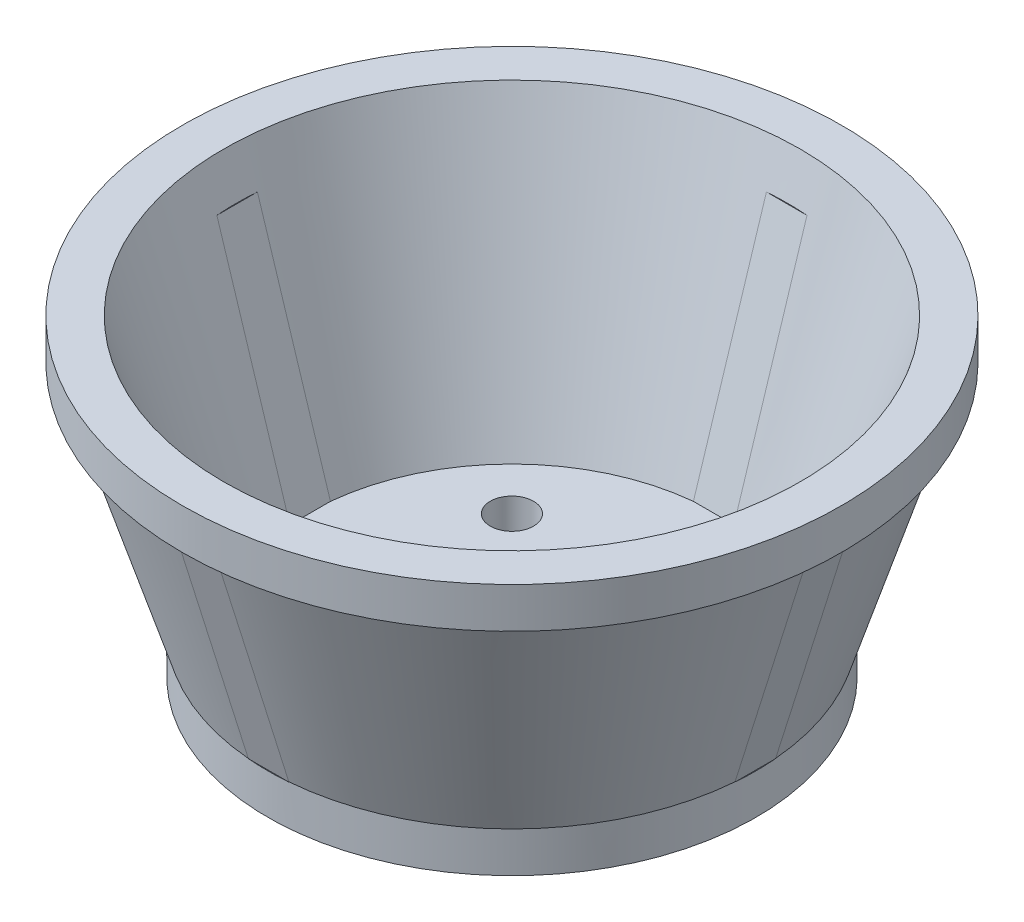
ISO-10303-21;
HEADER;
FILE_DESCRIPTION(('STEP AP214'),'2;1');
FILE_NAME('part.step','',(''),(''),'','','');
FILE_SCHEMA(('AUTOMOTIVE_DESIGN { 1 0 10303 214 1 1 1 1 }'));
ENDSEC;
DATA;
#1=APPLICATION_CONTEXT('core data for automotive mechanical design processes');
#2=APPLICATION_PROTOCOL_DEFINITION('international standard','automotive_design',2000,#1);
#3=PRODUCT_CONTEXT('',#1,'mechanical');
#4=PRODUCT('Part','Part','',(#3));
#5=PRODUCT_RELATED_PRODUCT_CATEGORY('part','',(#4));
#6=PRODUCT_DEFINITION_FORMATION('','',#4);
#7=PRODUCT_DEFINITION_CONTEXT('part definition',#1,'design');
#8=PRODUCT_DEFINITION('design','',#6,#7);
#9=PRODUCT_DEFINITION_SHAPE('','',#8);
#10=(LENGTH_UNIT() NAMED_UNIT(*) SI_UNIT(.MILLI.,.METRE.));
#11=(NAMED_UNIT(*) PLANE_ANGLE_UNIT() SI_UNIT($,.RADIAN.));
#12=(NAMED_UNIT(*) SI_UNIT($,.STERADIAN.) SOLID_ANGLE_UNIT());
#13=UNCERTAINTY_MEASURE_WITH_UNIT(LENGTH_MEASURE(1.E-05),#10,'distance_accuracy_value','');
#14=(GEOMETRIC_REPRESENTATION_CONTEXT(3) GLOBAL_UNCERTAINTY_ASSIGNED_CONTEXT((#13)) GLOBAL_UNIT_ASSIGNED_CONTEXT((#10,
#11,#12)) REPRESENTATION_CONTEXT('',''));
#15=CARTESIAN_POINT('',(0.,0.,0.));
#16=DIRECTION('',(0.,0.,1.));
#17=DIRECTION('',(1.,0.,0.));
#18=AXIS2_PLACEMENT_3D('',#15,#16,#17);
#19=CARTESIAN_POINT('',(55.5,-46.25,0.));
#20=DIRECTION('',(0.,1.,0.));
#21=DIRECTION('',(0.,0.,1.));
#22=AXIS2_PLACEMENT_3D('',#19,#20,#21);
#23=PLANE('',#22);
#24=CARTESIAN_POINT('',(-14.8492424049174,-46.25,14.8492424049175));
#25=DIRECTION('',(0.,-1.,0.));
#26=DIRECTION('',(-1.,0.,0.));
#27=AXIS2_PLACEMENT_3D('',#24,#25,#26);
#28=CIRCLE('',#27,3.2);
#29=CARTESIAN_POINT('',(-18.0492424049174,-46.25,14.8492424049175));
#30=VERTEX_POINT('',#29);
#31=EDGE_CURVE('E655',#30,#30,#28,.T.);
#32=ORIENTED_EDGE('',*,*,#31,.F.);
#33=EDGE_LOOP('',(#32));
#34=FACE_BOUND('',#33,.T.);
#35=CARTESIAN_POINT('',(-14.8492424049173,-46.25,-14.8492424049176));
#36=DIRECTION('',(0.,-1.,0.));
#37=DIRECTION('',(0.,0.,-1.));
#38=AXIS2_PLACEMENT_3D('',#35,#36,#37);
#39=CIRCLE('',#38,3.2);
#40=CARTESIAN_POINT('',(-14.8492424049173,-46.25,-18.0492424049176));
#41=VERTEX_POINT('',#40);
#42=EDGE_CURVE('E654',#41,#41,#39,.T.);
#43=ORIENTED_EDGE('',*,*,#42,.F.);
#44=EDGE_LOOP('',(#43));
#45=FACE_BOUND('',#44,.T.);
#46=CARTESIAN_POINT('',(14.8492424049175,-46.25,14.8492424049175));
#47=DIRECTION('',(0.,-1.,0.));
#48=DIRECTION('',(0.,0.,1.));
#49=AXIS2_PLACEMENT_3D('',#46,#47,#48);
#50=CIRCLE('',#49,3.2);
#51=CARTESIAN_POINT('',(14.8492424049175,-46.25,18.0492424049175));
#52=VERTEX_POINT('',#51);
#53=EDGE_CURVE('E647',#52,#52,#50,.T.);
#54=ORIENTED_EDGE('',*,*,#53,.F.);
#55=EDGE_LOOP('',(#54));
#56=FACE_BOUND('',#55,.T.);
#57=CARTESIAN_POINT('',(14.8492424049175,-46.25,-14.8492424049175));
#58=DIRECTION('',(0.,-1.,0.));
#59=DIRECTION('',(1.,0.,0.));
#60=AXIS2_PLACEMENT_3D('',#57,#58,#59);
#61=CIRCLE('',#60,3.2);
#62=CARTESIAN_POINT('',(18.0492424049175,-46.25,-14.8492424049175));
#63=VERTEX_POINT('',#62);
#64=EDGE_CURVE('E641',#63,#63,#61,.T.);
#65=ORIENTED_EDGE('',*,*,#64,.F.);
#66=EDGE_LOOP('',(#65));
#67=FACE_BOUND('',#66,.T.);
#68=CARTESIAN_POINT('',(0.,-46.2500000000001,0.));
#69=DIRECTION('',(0.,1.,0.));
#70=DIRECTION('',(-1.,0.,0.));
#71=AXIS2_PLACEMENT_3D('',#68,#69,#70);
#72=CIRCLE('',#71,3.175);
#73=CARTESIAN_POINT('',(-3.175,-46.2500000000001,0.));
#74=VERTEX_POINT('',#73);
#75=EDGE_CURVE('E636',#74,#74,#72,.T.);
#76=ORIENTED_EDGE('',*,*,#75,.T.);
#77=EDGE_LOOP('',(#76));
#78=FACE_BOUND('',#77,.T.);
#79=CARTESIAN_POINT('',(0.,-46.25,0.));
#80=DIRECTION('',(0.,-1.,0.));
#81=DIRECTION('',(0.,0.,-1.));
#82=AXIS2_PLACEMENT_3D('',#79,#80,#81);
#83=CIRCLE('',#82,36.1179115486692);
#84=CARTESIAN_POINT('',(0.,-46.25,-36.1179115486692));
#85=VERTEX_POINT('',#84);
#86=EDGE_CURVE('E728',#85,#85,#83,.T.);
#87=ORIENTED_EDGE('',*,*,#86,.T.);
#88=EDGE_LOOP('',(#87));
#89=FACE_BOUND('',#88,.T.);
#90=ADVANCED_FACE('F56',(#34,#45,#56,#67,#78,#89),#23,.F.);
#91=CARTESIAN_POINT('',(36.1179115486692,-40.29713119,0.));
#92=DIRECTION('',(0.,-1.,0.));
#93=DIRECTION('',(0.,0.,-1.));
#94=AXIS2_PLACEMENT_3D('',#91,#92,#93);
#95=PLANE('',#94);
#96=CARTESIAN_POINT('',(0.,-40.29713119,0.));
#97=DIRECTION('',(0.,-1.,0.));
#98=DIRECTION('',(0.,0.,-1.));
#99=AXIS2_PLACEMENT_3D('',#96,#97,#98);
#100=CIRCLE('',#99,36.1179115486692);
#101=CARTESIAN_POINT('',(35.9931039872569,-40.29713119,-3.00000000000002));
#102=VERTEX_POINT('',#101);
#103=CARTESIAN_POINT('',(35.9931039872569,-40.29713119,3.00000000000002));
#104=VERTEX_POINT('',#103);
#105=EDGE_CURVE('E257',#102,#104,#100,.T.);
#106=ORIENTED_EDGE('',*,*,#105,.F.);
#107=DIRECTION('',(0.,0.,1.));
#108=VECTOR('',#107,1.);
#109=CARTESIAN_POINT('',(35.9931039872569,-40.2971311900001,-48.7589667799538));
#110=LINE('',#109,#108);
#111=EDGE_CURVE('E392',#102,#104,#110,.T.);
#112=ORIENTED_EDGE('',*,*,#111,.T.);
#113=EDGE_LOOP('',(#106,#112));
#114=FACE_BOUND('',#113,.T.);
#115=ADVANCED_FACE('F753',(#114),#95,.F.);
#116=CARTESIAN_POINT('',(2.99999999999994,-40.2971311900001,35.993103987257));
#117=VERTEX_POINT('',#116);
#118=CARTESIAN_POINT('',(-3.00000000000014,-40.2971311900001,35.9931039872569));
#119=VERTEX_POINT('',#118);
#120=EDGE_CURVE('E803',#117,#119,#100,.T.);
#121=ORIENTED_EDGE('',*,*,#120,.F.);
#122=DIRECTION('',(-1.,0.,0.));
#123=VECTOR('',#122,1.);
#124=CARTESIAN_POINT('',(48.7589667799538,-40.2971311900001,35.9931039872571));
#125=LINE('',#124,#123);
#126=EDGE_CURVE('E370',#117,#119,#125,.T.);
#127=ORIENTED_EDGE('',*,*,#126,.T.);
#128=EDGE_LOOP('',(#121,#127));
#129=FACE_BOUND('',#128,.T.);
#130=ADVANCED_FACE('F759',(#129),#95,.F.);
#131=CARTESIAN_POINT('',(-35.9931039872569,-40.2971311900001,3.00000000000007));
#132=VERTEX_POINT('',#131);
#133=CARTESIAN_POINT('',(-35.9931039872569,-40.29713119,-3.00000000000002));
#134=VERTEX_POINT('',#133);
#135=EDGE_CURVE('E266',#132,#134,#100,.T.);
#136=ORIENTED_EDGE('',*,*,#135,.F.);
#137=DIRECTION('',(0.,0.,-1.));
#138=VECTOR('',#137,1.);
#139=CARTESIAN_POINT('',(-35.9931039872569,-40.2971311900001,48.7589667799538));
#140=LINE('',#139,#138);
#141=EDGE_CURVE('E314',#132,#134,#140,.T.);
#142=ORIENTED_EDGE('',*,*,#141,.T.);
#143=EDGE_LOOP('',(#136,#142));
#144=FACE_BOUND('',#143,.T.);
#145=ADVANCED_FACE('F719',(#144),#95,.F.);
#146=CARTESIAN_POINT('',(-2.99999999999969,-40.2971311900001,-35.993103987257));
#147=VERTEX_POINT('',#146);
#148=CARTESIAN_POINT('',(3.00000000000047,-40.29713119,-35.9931039872569));
#149=VERTEX_POINT('',#148);
#150=EDGE_CURVE('E252',#147,#149,#100,.T.);
#151=ORIENTED_EDGE('',*,*,#150,.F.);
#152=DIRECTION('',(1.,0.,0.));
#153=VECTOR('',#152,1.);
#154=CARTESIAN_POINT('',(-48.7589667799539,-40.2971311900001,-35.9931039872574));
#155=LINE('',#154,#153);
#156=EDGE_CURVE('E319',#147,#149,#155,.T.);
#157=ORIENTED_EDGE('',*,*,#156,.T.);
#158=EDGE_LOOP('',(#151,#157));
#159=FACE_BOUND('',#158,.T.);
#160=ADVANCED_FACE('F750',(#159),#95,.F.);
#161=CARTESIAN_POINT('',(0.,-40.2971311900001,0.));
#162=DIRECTION('',(0.,1.,0.));
#163=DIRECTION('',(0.,0.,1.));
#164=AXIS2_PLACEMENT_3D('',#161,#162,#163);
#165=CONICAL_SURFACE('',#164,36.1179115486692,0.304506404561857);
#166=CARTESIAN_POINT('',(0.,-40.25,0.));
#167=DIRECTION('',(0.,-1.,0.));
#168=DIRECTION('',(0.,0.,-1.));
#169=AXIS2_PLACEMENT_3D('',#166,#167,#168);
#170=CIRCLE('',#169,36.1327239764503);
#171=CARTESIAN_POINT('',(-3.00000000868257,-40.25,36.0079677558488));
#172=VERTEX_POINT('',#171);
#173=CARTESIAN_POINT('',(-36.0079559287124,-40.25,3.00014196235004));
#174=VERTEX_POINT('',#173);
#175=EDGE_CURVE('E277',#172,#174,#170,.T.);
#176=ORIENTED_EDGE('',*,*,#175,.F.);
#177=CARTESIAN_POINT('',(-3.00000000000018,-6.00000000000002,46.8007874877763));
#178=DIRECTION('',(0.,-0.953766069075102,-0.300549971686953));
#179=VECTOR('',#178,1.);
#180=LINE('',#177,#179);
#181=CARTESIAN_POINT('',(-3.00000000000016,-6.00000000000004,46.8007874877763));
#182=VERTEX_POINT('',#181);
#183=EDGE_CURVE('E382',#182,#172,#180,.T.);
#184=ORIENTED_EDGE('',*,*,#183,.F.);
#185=CARTESIAN_POINT('',(0.,-6.00000000000004,0.));
#186=DIRECTION('',(0.,1.,0.));
#187=DIRECTION('',(0.,0.,1.));
#188=AXIS2_PLACEMENT_3D('',#185,#186,#187);
#189=CIRCLE('',#188,46.8968411460303);
#190=CARTESIAN_POINT('',(-46.8007874877763,-6.00000000000004,3.00000000000013));
#191=VERTEX_POINT('',#190);
#192=EDGE_CURVE('E313',#191,#182,#189,.T.);
#193=ORIENTED_EDGE('',*,*,#192,.F.);
#194=CARTESIAN_POINT('',(-41.396945737515,-23.1485655950052,0.));
#195=DIRECTION('',(0.953766069075102,0.300549971686953,0.));
#196=DIRECTION('',(-0.300549971686953,0.953766069075102,0.));
#197=AXIS2_PLACEMENT_3D('',#194,#195,#196);
#198=ELLIPSE('',#197,138.104742164432,3.0257519471421);
#199=EDGE_CURVE('E306',#174,#191,#198,.F.);
#200=ORIENTED_EDGE('',*,*,#199,.F.);
#201=EDGE_LOOP('',(#176,#184,#193,#200));
#202=FACE_BOUND('',#201,.T.);
#203=ADVANCED_FACE('F311',(#202),#165,.T.);
#204=CARTESIAN_POINT('',(0.,-40.25,0.));
#205=DIRECTION('',(0.,-1.,0.));
#206=DIRECTION('',(0.,0.,-1.));
#207=AXIS2_PLACEMENT_3D('',#204,#205,#206);
#208=CIRCLE('',#207,36.1327239764503);
#209=CARTESIAN_POINT('',(36.0079677558489,-40.25,3.00000000868247));
#210=VERTEX_POINT('',#209);
#211=CARTESIAN_POINT('',(3.00014196235066,-40.25,36.0079559287124));
#212=VERTEX_POINT('',#211);
#213=EDGE_CURVE('E790',#210,#212,#208,.T.);
#214=ORIENTED_EDGE('',*,*,#213,.F.);
#215=CARTESIAN_POINT('',(46.8007874877763,-6.00000000000004,3.));
#216=DIRECTION('',(-0.300549971686952,-0.953766069075102,0.));
#217=VECTOR('',#216,1.);
#218=LINE('',#215,#217);
#219=CARTESIAN_POINT('',(46.8007874877763,-6.00000000000004,3.));
#220=VERTEX_POINT('',#219);
#221=EDGE_CURVE('E407',#220,#210,#218,.T.);
#222=ORIENTED_EDGE('',*,*,#221,.F.);
#223=CARTESIAN_POINT('',(3.00000000000004,-6.00000000000004,46.8007874877763));
#224=VERTEX_POINT('',#223);
#225=EDGE_CURVE('E669',#224,#220,#189,.T.);
#226=ORIENTED_EDGE('',*,*,#225,.F.);
#227=CARTESIAN_POINT('',(-1.44536663527651E-13,-23.1485655949913,41.3969457375194));
#228=DIRECTION('',(0.,0.300549971686953,-0.953766069075102));
#229=DIRECTION('',(0.,0.953766069075102,0.300549971686953));
#230=AXIS2_PLACEMENT_3D('',#227,#228,#229);
#231=ELLIPSE('',#230,138.104742164502,3.02575194714287);
#232=EDGE_CURVE('E329',#212,#224,#231,.F.);
#233=ORIENTED_EDGE('',*,*,#232,.F.);
#234=EDGE_LOOP('',(#214,#222,#226,#233));
#235=FACE_BOUND('',#234,.T.);
#236=ADVANCED_FACE('F758',(#235),#165,.T.);
#237=CARTESIAN_POINT('',(0.,-40.25,0.));
#238=DIRECTION('',(0.,-1.,0.));
#239=DIRECTION('',(0.,0.,-1.));
#240=AXIS2_PLACEMENT_3D('',#237,#238,#239);
#241=CIRCLE('',#240,36.1327239764503);
#242=CARTESIAN_POINT('',(3.00000000000035,-40.25,-36.0079559287123));
#243=VERTEX_POINT('',#242);
#244=CARTESIAN_POINT('',(36.0079559287124,-40.25,-3.00014196234989));
#245=VERTEX_POINT('',#244);
#246=EDGE_CURVE('E273',#243,#245,#241,.T.);
#247=ORIENTED_EDGE('',*,*,#246,.F.);
#248=CARTESIAN_POINT('',(3.00000000868138,-40.2500033925078,-36.0079666859549));
#249=CARTESIAN_POINT('',(3.00000245941903,-38.9853559764633,-36.4067977000971));
#250=CARTESIAN_POINT('',(3.00001954308934,-37.720695240445,-36.8055864753634));
#251=CARTESIAN_POINT('',(3.00006640061755,-35.1449679944873,-37.6177119762073));
#252=CARTESIAN_POINT('',(3.00009661690849,-33.8339005873397,-38.0310458562));
#253=CARTESIAN_POINT('',(3.000151324488,-31.1653600531946,-38.8722624373405));
#254=CARTESIAN_POINT('',(3.00017557542182,-29.8078861016305,-39.3001425227534));
#255=CARTESIAN_POINT('',(3.00020932259654,-27.0465323770515,-40.1704515598064));
#256=CARTESIAN_POINT('',(3.00021828637307,-25.6426518360708,-40.6128780748248));
#257=CARTESIAN_POINT('',(3.00021810235333,-22.7884848885063,-41.5122799107001));
#258=CARTESIAN_POINT('',(3.00020834636643,-21.3381977641227,-41.9692529536736));
#259=CARTESIAN_POINT('',(3.00017420151849,-18.3912175951543,-42.8977475075505));
#260=CARTESIAN_POINT('',(3.00014935463104,-16.8945238755367,-43.3692668759152));
#261=CARTESIAN_POINT('',(3.00009479407644,-13.8547304901389,-44.3268536275629));
#262=CARTESIAN_POINT('',(3.00006495344392,-12.3116301871599,-44.8129189880842));
#263=CARTESIAN_POINT('',(3.00001766196752,-9.17902354061638,-45.7995968827285));
#264=CARTESIAN_POINT('',(3.00000061052733,-7.5895165907309,-46.3002074918627));
#265=CARTESIAN_POINT('',(3.00000000000017,-6.00000000000004,-46.8007874877763));
#266=B_SPLINE_CURVE_WITH_KNOTS('',3,(#248,#249,#250,#251,#252,#253,#254,#255,#256,#257,#258,
#259,#260,#261,#262,#263,#264,#265),.UNSPECIFIED.,.F.,.F.,(4,2,2,2,2,2,2,2,4),(0.,
3.97813943538034,8.10217674954968,12.3721125871892,16.787947291253,21.3496809453268,
26.0573134114565,30.9108443644778,35.9102733236664),.UNSPECIFIED.);
#267=CARTESIAN_POINT('',(3.00000000000043,-6.00000000000004,-46.8007874877763));
#268=VERTEX_POINT('',#267);
#269=EDGE_CURVE('E272',#243,#268,#266,.T.);
#270=ORIENTED_EDGE('',*,*,#269,.T.);
#271=CARTESIAN_POINT('',(46.8007874877763,-6.00000000000004,-3.00000000000013));
#272=VERTEX_POINT('',#271);
#273=EDGE_CURVE('E582',#272,#268,#189,.T.);
#274=ORIENTED_EDGE('',*,*,#273,.F.);
#275=CARTESIAN_POINT('',(41.396945737515,-23.1485655950052,0.));
#276=DIRECTION('',(-0.953766069075102,0.300549971686953,0.));
#277=DIRECTION('',(0.300549971686953,0.953766069075102,0.));
#278=AXIS2_PLACEMENT_3D('',#275,#276,#277);
#279=ELLIPSE('',#278,138.104742164432,3.0257519471421);
#280=EDGE_CURVE('E373',#245,#272,#279,.F.);
#281=ORIENTED_EDGE('',*,*,#280,.F.);
#282=EDGE_LOOP('',(#247,#270,#274,#281));
#283=FACE_BOUND('',#282,.T.);
#284=ADVANCED_FACE('F814',(#283),#165,.T.);
#285=CARTESIAN_POINT('',(0.,-40.25,0.));
#286=DIRECTION('',(0.,-1.,0.));
#287=DIRECTION('',(0.,0.,-1.));
#288=AXIS2_PLACEMENT_3D('',#285,#286,#287);
#289=CIRCLE('',#288,36.1327239764503);
#290=CARTESIAN_POINT('',(-36.0079559287124,-40.25,-2.99999999999998));
#291=VERTEX_POINT('',#290);
#292=CARTESIAN_POINT('',(-3.00014196234952,-40.25,-36.0079559287124));
#293=VERTEX_POINT('',#292);
#294=EDGE_CURVE('E288',#291,#293,#289,.T.);
#295=ORIENTED_EDGE('',*,*,#294,.F.);
#296=CARTESIAN_POINT('',(-46.8007874877763,-6.00000000000004,-3.));
#297=DIRECTION('',(0.300549971686952,-0.953766069075102,0.));
#298=VECTOR('',#297,1.);
#299=LINE('',#296,#298);
#300=CARTESIAN_POINT('',(-46.8007874877763,-6.00000000000004,-3.));
#301=VERTEX_POINT('',#300);
#302=EDGE_CURVE('E335',#301,#291,#299,.T.);
#303=ORIENTED_EDGE('',*,*,#302,.F.);
#304=CARTESIAN_POINT('',(-2.99999999999971,-6.00000000000004,-46.8007874877763));
#305=VERTEX_POINT('',#304);
#306=EDGE_CURVE('E687',#305,#301,#189,.T.);
#307=ORIENTED_EDGE('',*,*,#306,.F.);
#308=CARTESIAN_POINT('',(4.33609990582906E-13,-23.1485655950052,-41.396945737515));
#309=DIRECTION('',(0.,0.300549971686953,0.953766069075102));
#310=DIRECTION('',(0.,0.953766069075102,-0.300549971686953));
#311=AXIS2_PLACEMENT_3D('',#308,#309,#310);
#312=ELLIPSE('',#311,138.104742164432,3.0257519471421);
#313=EDGE_CURVE('E326',#293,#305,#312,.F.);
#314=ORIENTED_EDGE('',*,*,#313,.F.);
#315=EDGE_LOOP('',(#295,#303,#307,#314));
#316=FACE_BOUND('',#315,.T.);
#317=ADVANCED_FACE('F421',(#316),#165,.T.);
#318=CARTESIAN_POINT('',(35.9931039872569,-40.2971311900001,-48.7589667799538));
#319=DIRECTION('',(-0.953766069075102,0.300549971686953,0.));
#320=DIRECTION('',(-0.300549971686953,-0.953766069075102,0.));
#321=AXIS2_PLACEMENT_3D('',#318,#319,#320);
#322=PLANE('',#321);
#323=DIRECTION('',(0.,0.,1.));
#324=VECTOR('',#323,1.);
#325=CARTESIAN_POINT('',(36.0079559287124,-40.25,-48.7589667799538));
#326=LINE('',#325,#324);
#327=CARTESIAN_POINT('',(36.0079559287124,-40.25,2.81613999534799));
#328=VERTEX_POINT('',#327);
#329=EDGE_CURVE('E323',#328,#210,#326,.T.);
#330=ORIENTED_EDGE('',*,*,#329,.F.);
#331=CARTESIAN_POINT('',(0.,-154.51774186267,0.));
#332=DIRECTION('',(-0.953766069075102,0.300549971686953,0.));
#333=DIRECTION('',(-0.300549971686953,-0.953766069075102,0.));
#334=AXIS2_PLACEMENT_3D('',#331,#332,#333);
#335=ELLIPSE('',#334,120.172733159626,36.1179115486692);
#336=EDGE_CURVE('E743',#104,#328,#335,.T.);
#337=ORIENTED_EDGE('',*,*,#336,.F.);
#338=ORIENTED_EDGE('',*,*,#111,.F.);
#339=CARTESIAN_POINT('',(36.0079559287124,-40.25,-2.81613999534799));
#340=VERTEX_POINT('',#339);
#341=EDGE_CURVE('E258',#340,#102,#335,.T.);
#342=ORIENTED_EDGE('',*,*,#341,.F.);
#343=EDGE_CURVE('E265',#245,#340,#326,.T.);
#344=ORIENTED_EDGE('',*,*,#343,.F.);
#345=ORIENTED_EDGE('',*,*,#280,.T.);
#346=DIRECTION('',(0.,0.,1.));
#347=VECTOR('',#346,1.);
#348=CARTESIAN_POINT('',(46.8007874877763,-6.00000000000004,-48.7589667799538));
#349=LINE('',#348,#347);
#350=EDGE_CURVE('E393',#272,#220,#349,.T.);
#351=ORIENTED_EDGE('',*,*,#350,.T.);
#352=ORIENTED_EDGE('',*,*,#221,.T.);
#353=EDGE_LOOP('',(#330,#337,#338,#342,#344,#345,#351,#352));
#354=FACE_BOUND('',#353,.T.);
#355=ADVANCED_FACE('F412',(#354),#322,.F.);
#356=CARTESIAN_POINT('',(48.7589667799538,-40.2971311900001,35.9931039872571));
#357=DIRECTION('',(0.,0.300549971686953,-0.953766069075102));
#358=DIRECTION('',(0.,0.953766069075102,0.300549971686953));
#359=AXIS2_PLACEMENT_3D('',#356,#357,#358);
#360=PLANE('',#359);
#361=DIRECTION('',(-1.,0.,0.));
#362=VECTOR('',#361,1.);
#363=CARTESIAN_POINT('',(48.7589667799538,-40.25,36.0079559287126));
#364=LINE('',#363,#362);
#365=CARTESIAN_POINT('',(-2.81613999534818,-40.25,36.0079559287124));
#366=VERTEX_POINT('',#365);
#367=EDGE_CURVE('E274',#366,#172,#364,.T.);
#368=ORIENTED_EDGE('',*,*,#367,.F.);
#369=CARTESIAN_POINT('',(0.,-154.51774186267,0.));
#370=DIRECTION('',(0.,0.300549971686953,-0.953766069075102));
#371=DIRECTION('',(0.,-0.953766069075102,-0.300549971686953));
#372=AXIS2_PLACEMENT_3D('',#369,#370,#371);
#373=ELLIPSE('',#372,120.172733159626,36.1179115486692);
#374=EDGE_CURVE('E804',#119,#366,#373,.T.);
#375=ORIENTED_EDGE('',*,*,#374,.F.);
#376=ORIENTED_EDGE('',*,*,#126,.F.);
#377=CARTESIAN_POINT('',(2.81613999534793,-40.25,36.0079559287124));
#378=VERTEX_POINT('',#377);
#379=EDGE_CURVE('E745',#378,#117,#373,.T.);
#380=ORIENTED_EDGE('',*,*,#379,.F.);
#381=EDGE_CURVE('E281',#212,#378,#364,.T.);
#382=ORIENTED_EDGE('',*,*,#381,.F.);
#383=ORIENTED_EDGE('',*,*,#232,.T.);
#384=DIRECTION('',(-1.,0.,0.));
#385=VECTOR('',#384,1.);
#386=CARTESIAN_POINT('',(48.7589667799538,-6.00000000000004,46.8007874877765));
#387=LINE('',#386,#385);
#388=EDGE_CURVE('E371',#224,#182,#387,.T.);
#389=ORIENTED_EDGE('',*,*,#388,.T.);
#390=ORIENTED_EDGE('',*,*,#183,.T.);
#391=EDGE_LOOP('',(#368,#375,#376,#380,#382,#383,#389,#390));
#392=FACE_BOUND('',#391,.T.);
#393=ADVANCED_FACE('F355',(#392),#360,.F.);
#394=CARTESIAN_POINT('',(-48.7589667799539,-40.2971311900001,-35.9931039872574));
#395=DIRECTION('',(0.,0.300549971686953,0.953766069075102));
#396=DIRECTION('',(0.,-0.953766069075102,0.300549971686953));
#397=AXIS2_PLACEMENT_3D('',#394,#395,#396);
#398=PLANE('',#397);
#399=DIRECTION('',(1.,0.,0.));
#400=VECTOR('',#399,1.);
#401=CARTESIAN_POINT('',(-48.7589667799539,-40.25,-36.0079559287129));
#402=LINE('',#401,#400);
#403=CARTESIAN_POINT('',(2.81613999534837,-40.25,-36.0079559287123));
#404=VERTEX_POINT('',#403);
#405=EDGE_CURVE('E262',#404,#243,#402,.T.);
#406=ORIENTED_EDGE('',*,*,#405,.F.);
#407=CARTESIAN_POINT('',(0.,-154.51774186267,0.));
#408=DIRECTION('',(0.,0.300549971686953,0.953766069075102));
#409=DIRECTION('',(0.,-0.953766069075102,0.300549971686953));
#410=AXIS2_PLACEMENT_3D('',#407,#408,#409);
#411=ELLIPSE('',#410,120.172733159626,36.1179115486692);
#412=EDGE_CURVE('E245',#149,#404,#411,.T.);
#413=ORIENTED_EDGE('',*,*,#412,.F.);
#414=ORIENTED_EDGE('',*,*,#156,.F.);
#415=CARTESIAN_POINT('',(-2.81613999534761,-40.25,-36.0079559287124));
#416=VERTEX_POINT('',#415);
#417=EDGE_CURVE('E720',#416,#147,#411,.T.);
#418=ORIENTED_EDGE('',*,*,#417,.F.);
#419=EDGE_CURVE('E284',#293,#416,#402,.T.);
#420=ORIENTED_EDGE('',*,*,#419,.F.);
#421=ORIENTED_EDGE('',*,*,#313,.T.);
#422=DIRECTION('',(1.,0.,0.));
#423=VECTOR('',#422,1.);
#424=CARTESIAN_POINT('',(-48.7589667799538,-6.00000000000004,-46.8007874877768));
#425=LINE('',#424,#423);
#426=EDGE_CURVE('E315',#305,#268,#425,.T.);
#427=ORIENTED_EDGE('',*,*,#426,.T.);
#428=ORIENTED_EDGE('',*,*,#269,.F.);
#429=EDGE_LOOP('',(#406,#413,#414,#418,#420,#421,#427,#428));
#430=FACE_BOUND('',#429,.T.);
#431=ADVANCED_FACE('F270',(#430),#398,.F.);
#432=CARTESIAN_POINT('',(-35.9931039872569,-40.2971311900001,48.7589667799538));
#433=DIRECTION('',(0.953766069075102,0.300549971686953,0.));
#434=DIRECTION('',(-0.300549971686953,0.953766069075102,0.));
#435=AXIS2_PLACEMENT_3D('',#432,#433,#434);
#436=PLANE('',#435);
#437=DIRECTION('',(0.,0.,-1.));
#438=VECTOR('',#437,1.);
#439=CARTESIAN_POINT('',(-36.0079559287124,-40.25,48.7589667799538));
#440=LINE('',#439,#438);
#441=CARTESIAN_POINT('',(-36.0079559287124,-40.25,-2.81613999534799));
#442=VERTEX_POINT('',#441);
#443=EDGE_CURVE('E13',#442,#291,#440,.T.);
#444=ORIENTED_EDGE('',*,*,#443,.F.);
#445=CARTESIAN_POINT('',(0.,-154.51774186267,0.));
#446=DIRECTION('',(0.953766069075102,0.300549971686953,0.));
#447=DIRECTION('',(0.300549971686953,-0.953766069075102,0.));
#448=AXIS2_PLACEMENT_3D('',#445,#446,#447);
#449=ELLIPSE('',#448,120.172733159626,36.1179115486692);
#450=EDGE_CURVE('E66',#134,#442,#449,.T.);
#451=ORIENTED_EDGE('',*,*,#450,.F.);
#452=ORIENTED_EDGE('',*,*,#141,.F.);
#453=CARTESIAN_POINT('',(-36.0079559287124,-40.25,2.81613999534799));
#454=VERTEX_POINT('',#453);
#455=EDGE_CURVE('E308',#454,#132,#449,.T.);
#456=ORIENTED_EDGE('',*,*,#455,.F.);
#457=EDGE_CURVE('E297',#174,#454,#440,.T.);
#458=ORIENTED_EDGE('',*,*,#457,.F.);
#459=ORIENTED_EDGE('',*,*,#199,.T.);
#460=DIRECTION('',(0.,0.,-1.));
#461=VECTOR('',#460,1.);
#462=CARTESIAN_POINT('',(-46.8007874877763,-6.00000000000004,48.7589667799538));
#463=LINE('',#462,#461);
#464=EDGE_CURVE('E150',#191,#301,#463,.T.);
#465=ORIENTED_EDGE('',*,*,#464,.T.);
#466=ORIENTED_EDGE('',*,*,#302,.T.);
#467=EDGE_LOOP('',(#444,#451,#452,#456,#458,#459,#465,#466));
#468=FACE_BOUND('',#467,.T.);
#469=ADVANCED_FACE('F305',(#468),#436,.F.);
#470=CARTESIAN_POINT('',(0.,-46.2500000000001,0.));
#471=DIRECTION('',(0.,1.,0.));
#472=DIRECTION('',(0.,0.,1.));
#473=AXIS2_PLACEMENT_3D('',#470,#471,#472);
#474=CYLINDRICAL_SURFACE('',#473,48.7579667799538);
#475=CARTESIAN_POINT('',(0.,-6.00000000000003,0.));
#476=DIRECTION('',(0.,1.,0.));
#477=DIRECTION('',(0.,0.,1.));
#478=AXIS2_PLACEMENT_3D('',#475,#476,#477);
#479=CIRCLE('',#478,48.7579667799538);
#480=CARTESIAN_POINT('',(0.,-6.00000000000003,48.7579667799538));
#481=VERTEX_POINT('',#480);
#482=EDGE_CURVE('E565',#481,#481,#479,.T.);
#483=ORIENTED_EDGE('',*,*,#482,.T.);
#484=EDGE_LOOP('',(#483));
#485=FACE_BOUND('',#484,.T.);
#486=CARTESIAN_POINT('',(0.,0.,0.));
#487=DIRECTION('',(0.,1.,0.));
#488=DIRECTION('',(0.,0.,1.));
#489=AXIS2_PLACEMENT_3D('',#486,#487,#488);
#490=CIRCLE('',#489,48.7579667799538);
#491=CARTESIAN_POINT('',(0.,0.,48.7579667799538));
#492=VERTEX_POINT('',#491);
#493=EDGE_CURVE('E395',#492,#492,#490,.T.);
#494=ORIENTED_EDGE('',*,*,#493,.F.);
#495=EDGE_LOOP('',(#494));
#496=FACE_BOUND('',#495,.T.);
#497=ADVANCED_FACE('F349',(#485,#496),#474,.T.);
#498=CARTESIAN_POINT('',(42.6498019292145,0.,0.));
#499=DIRECTION('',(0.,-1.,0.));
#500=DIRECTION('',(0.,0.,-1.));
#501=AXIS2_PLACEMENT_3D('',#498,#499,#500);
#502=PLANE('',#501);
#503=CARTESIAN_POINT('',(0.,0.,0.));
#504=DIRECTION('',(0.,1.,0.));
#505=DIRECTION('',(0.,0.,1.));
#506=AXIS2_PLACEMENT_3D('',#503,#504,#505);
#507=CIRCLE('',#506,42.6498019292145);
#508=CARTESIAN_POINT('',(0.,0.,42.6498019292145));
#509=VERTEX_POINT('',#508);
#510=EDGE_CURVE('E569',#509,#509,#507,.T.);
#511=ORIENTED_EDGE('',*,*,#510,.F.);
#512=EDGE_LOOP('',(#511));
#513=FACE_BOUND('',#512,.T.);
#514=ORIENTED_EDGE('',*,*,#493,.T.);
#515=EDGE_LOOP('',(#514));
#516=FACE_BOUND('',#515,.T.);
#517=ADVANCED_FACE('F58',(#513,#516),#502,.F.);
#518=CARTESIAN_POINT('',(172.649801929214,-6.00000000000003,0.));
#519=DIRECTION('',(0.,1.,0.));
#520=DIRECTION('',(0.,0.,1.));
#521=AXIS2_PLACEMENT_3D('',#518,#519,#520);
#522=PLANE('',#521);
#523=ORIENTED_EDGE('',*,*,#464,.F.);
#524=ORIENTED_EDGE('',*,*,#192,.T.);
#525=ORIENTED_EDGE('',*,*,#388,.F.);
#526=ORIENTED_EDGE('',*,*,#225,.T.);
#527=ORIENTED_EDGE('',*,*,#350,.F.);
#528=ORIENTED_EDGE('',*,*,#273,.T.);
#529=ORIENTED_EDGE('',*,*,#426,.F.);
#530=ORIENTED_EDGE('',*,*,#306,.T.);
#531=EDGE_LOOP('',(#523,#524,#525,#526,#527,#528,#529,#530));
#532=FACE_BOUND('',#531,.T.);
#533=ORIENTED_EDGE('',*,*,#482,.F.);
#534=EDGE_LOOP('',(#533));
#535=FACE_BOUND('',#534,.T.);
#536=ADVANCED_FACE('F809',(#532,#535),#522,.F.);
#537=CARTESIAN_POINT('',(0.,-46.2500000000001,0.));
#538=DIRECTION('',(0.,1.,0.));
#539=DIRECTION('',(-1.,0.,0.));
#540=AXIS2_PLACEMENT_3D('',#537,#538,#539);
#541=CYLINDRICAL_SURFACE('',#540,3.175);
#542=ORIENTED_EDGE('',*,*,#75,.F.);
#543=EDGE_LOOP('',(#542));
#544=FACE_BOUND('',#543,.T.);
#545=CARTESIAN_POINT('',(0.,-40.25,0.));
#546=DIRECTION('',(0.,1.,0.));
#547=DIRECTION('',(-1.,0.,0.));
#548=AXIS2_PLACEMENT_3D('',#545,#546,#547);
#549=CIRCLE('',#548,3.175);
#550=CARTESIAN_POINT('',(-3.175,-40.25,0.));
#551=VERTEX_POINT('',#550);
#552=EDGE_CURVE('E632',#551,#551,#549,.T.);
#553=ORIENTED_EDGE('',*,*,#552,.T.);
#554=EDGE_LOOP('',(#553));
#555=FACE_BOUND('',#554,.T.);
#556=ADVANCED_FACE('F617',(#544,#555),#541,.F.);
#557=CARTESIAN_POINT('',(14.8492424049175,0.00100000000068795,-14.8492424049175));
#558=DIRECTION('',(0.,-1.,0.));
#559=DIRECTION('',(1.,0.,0.));
#560=AXIS2_PLACEMENT_3D('',#557,#558,#559);
#561=CYLINDRICAL_SURFACE('',#560,3.2);
#562=ORIENTED_EDGE('',*,*,#64,.T.);
#563=EDGE_LOOP('',(#562));
#564=FACE_BOUND('',#563,.T.);
#565=CARTESIAN_POINT('',(14.8492424049175,-40.25,-14.8492424049175));
#566=DIRECTION('',(0.,-1.,0.));
#567=DIRECTION('',(0.,0.,-1.));
#568=AXIS2_PLACEMENT_3D('',#565,#566,#567);
#569=CIRCLE('',#568,3.2);
#570=CARTESIAN_POINT('',(14.8492424049175,-40.25,-18.0492424049175));
#571=VERTEX_POINT('',#570);
#572=EDGE_CURVE('E635',#571,#571,#569,.F.);
#573=ORIENTED_EDGE('',*,*,#572,.T.);
#574=EDGE_LOOP('',(#573));
#575=FACE_BOUND('',#574,.T.);
#576=ADVANCED_FACE('F999',(#564,#575),#561,.F.);
#577=CARTESIAN_POINT('',(14.8492424049175,0.00100000000088918,14.8492424049175));
#578=DIRECTION('',(0.,-1.,0.));
#579=DIRECTION('',(1.,0.,0.));
#580=AXIS2_PLACEMENT_3D('',#577,#578,#579);
#581=CYLINDRICAL_SURFACE('',#580,3.2);
#582=ORIENTED_EDGE('',*,*,#53,.T.);
#583=EDGE_LOOP('',(#582));
#584=FACE_BOUND('',#583,.T.);
#585=CARTESIAN_POINT('',(14.8492424049175,-40.25,14.8492424049175));
#586=DIRECTION('',(0.,-1.,0.));
#587=DIRECTION('',(0.,0.,-1.));
#588=AXIS2_PLACEMENT_3D('',#585,#586,#587);
#589=CIRCLE('',#588,3.2);
#590=CARTESIAN_POINT('',(14.8492424049175,-40.25,11.6492424049175));
#591=VERTEX_POINT('',#590);
#592=EDGE_CURVE('E644',#591,#591,#589,.F.);
#593=ORIENTED_EDGE('',*,*,#592,.T.);
#594=EDGE_LOOP('',(#593));
#595=FACE_BOUND('',#594,.T.);
#596=ADVANCED_FACE('F989',(#584,#595),#581,.F.);
#597=CARTESIAN_POINT('',(-14.8492424049174,0.00100000000086836,-14.8492424049176));
#598=DIRECTION('',(0.,-1.,0.));
#599=DIRECTION('',(1.,0.,0.));
#600=AXIS2_PLACEMENT_3D('',#597,#598,#599);
#601=CYLINDRICAL_SURFACE('',#600,3.2);
#602=ORIENTED_EDGE('',*,*,#42,.T.);
#603=EDGE_LOOP('',(#602));
#604=FACE_BOUND('',#603,.T.);
#605=CARTESIAN_POINT('',(-14.8492424049173,-40.25,-14.8492424049176));
#606=DIRECTION('',(0.,-1.,0.));
#607=DIRECTION('',(0.,0.,-1.));
#608=AXIS2_PLACEMENT_3D('',#605,#606,#607);
#609=CIRCLE('',#608,3.2);
#610=CARTESIAN_POINT('',(-14.8492424049173,-40.25,-18.0492424049176));
#611=VERTEX_POINT('',#610);
#612=EDGE_CURVE('E651',#611,#611,#609,.F.);
#613=ORIENTED_EDGE('',*,*,#612,.T.);
#614=EDGE_LOOP('',(#613));
#615=FACE_BOUND('',#614,.T.);
#616=ADVANCED_FACE('F979',(#604,#615),#601,.F.);
#617=CARTESIAN_POINT('',(-14.8492424049175,0.00100000000086836,14.8492424049175));
#618=DIRECTION('',(0.,-1.,0.));
#619=DIRECTION('',(1.,0.,0.));
#620=AXIS2_PLACEMENT_3D('',#617,#618,#619);
#621=CYLINDRICAL_SURFACE('',#620,3.2);
#622=ORIENTED_EDGE('',*,*,#31,.T.);
#623=EDGE_LOOP('',(#622));
#624=FACE_BOUND('',#623,.T.);
#625=CARTESIAN_POINT('',(-14.8492424049174,-40.25,14.8492424049175));
#626=DIRECTION('',(0.,-1.,0.));
#627=DIRECTION('',(0.,0.,-1.));
#628=AXIS2_PLACEMENT_3D('',#625,#626,#627);
#629=CIRCLE('',#628,3.2);
#630=CARTESIAN_POINT('',(-14.8492424049174,-40.25,11.6492424049175));
#631=VERTEX_POINT('',#630);
#632=EDGE_CURVE('E650',#631,#631,#629,.F.);
#633=ORIENTED_EDGE('',*,*,#632,.T.);
#634=EDGE_LOOP('',(#633));
#635=FACE_BOUND('',#634,.T.);
#636=ADVANCED_FACE('F969',(#624,#635),#621,.F.);
#637=CARTESIAN_POINT('',(172.649801929214,-6.00000000000003,3.));
#638=DIRECTION('',(0.,-1.,0.));
#639=DIRECTION('',(1.,0.,0.));
#640=AXIS2_PLACEMENT_3D('',#637,#638,#639);
#641=PLANE('',#640);
#642=CARTESIAN_POINT('',(0.,-6.00000000000014,0.));
#643=DIRECTION('',(0.,-1.,0.));
#644=DIRECTION('',(1.,0.,0.));
#645=AXIS2_PLACEMENT_3D('',#642,#643,#644);
#646=CIRCLE('',#645,40.76411716958);
#647=CARTESIAN_POINT('',(-3.00000000000042,-6.00000000000015,40.6535760864311));
#648=VERTEX_POINT('',#647);
#649=CARTESIAN_POINT('',(2.99999999999986,-6.00000000000014,40.6535760864312));
#650=VERTEX_POINT('',#649);
#651=EDGE_CURVE('E492',#648,#650,#646,.F.);
#652=ORIENTED_EDGE('',*,*,#651,.T.);
#653=DIRECTION('',(1.,0.,0.));
#654=VECTOR('',#653,1.);
#655=CARTESIAN_POINT('',(-3.00000000000042,-6.00000000000015,40.6535760864311));
#656=LINE('',#655,#654);
#657=EDGE_CURVE('E587',#648,#650,#656,.T.);
#658=ORIENTED_EDGE('',*,*,#657,.F.);
#659=EDGE_LOOP('',(#652,#658));
#660=FACE_BOUND('',#659,.T.);
#661=ADVANCED_FACE('F929',(#660),#641,.F.);
#662=CARTESIAN_POINT('',(0.,-6.00000000000014,0.));
#663=DIRECTION('',(0.,-1.,0.));
#664=DIRECTION('',(1.,0.,0.));
#665=AXIS2_PLACEMENT_3D('',#662,#663,#664);
#666=CIRCLE('',#665,40.76411716958);
#667=CARTESIAN_POINT('',(40.6535760864311,-6.00000000000012,3.));
#668=VERTEX_POINT('',#667);
#669=CARTESIAN_POINT('',(40.6535760864311,-6.00000000000012,-3.));
#670=VERTEX_POINT('',#669);
#671=EDGE_CURVE('E585',#668,#670,#666,.F.);
#672=ORIENTED_EDGE('',*,*,#671,.T.);
#673=DIRECTION('',(0.,0.,-1.));
#674=VECTOR('',#673,1.);
#675=CARTESIAN_POINT('',(40.6535760864311,-6.00000000000012,3.));
#676=LINE('',#675,#674);
#677=EDGE_CURVE('E108',#668,#670,#676,.T.);
#678=ORIENTED_EDGE('',*,*,#677,.F.);
#679=EDGE_LOOP('',(#672,#678));
#680=FACE_BOUND('',#679,.T.);
#681=ADVANCED_FACE('F944',(#680),#641,.F.);
#682=CARTESIAN_POINT('',(40.6535760864311,-6.00000000000012,3.));
#683=DIRECTION('',(0.953677258863637,-0.300831657121286,0.));
#684=DIRECTION('',(0.300831657121286,0.953677258863637,0.));
#685=AXIS2_PLACEMENT_3D('',#682,#683,#684);
#686=PLANE('',#685);
#687=CARTESIAN_POINT('',(40.6535760864311,-6.00000000000012,-3.));
#688=DIRECTION('',(-0.300831657121286,-0.953677258863637,0.));
#689=VECTOR('',#688,1.);
#690=LINE('',#687,#689);
#691=CARTESIAN_POINT('',(29.8496231131987,-40.25,-3.));
#692=VERTEX_POINT('',#691);
#693=EDGE_CURVE('E517',#670,#692,#690,.T.);
#694=ORIENTED_EDGE('',*,*,#693,.T.);
#695=DIRECTION('',(0.,0.,-1.));
#696=VECTOR('',#695,1.);
#697=CARTESIAN_POINT('',(29.8496231131987,-40.25,3.));
#698=LINE('',#697,#696);
#699=CARTESIAN_POINT('',(29.8496231131987,-40.25,3.));
#700=VERTEX_POINT('',#699);
#701=EDGE_CURVE('E101',#700,#692,#698,.T.);
#702=ORIENTED_EDGE('',*,*,#701,.F.);
#703=CARTESIAN_POINT('',(40.6535760864312,-6.00000000000011,3.));
#704=CARTESIAN_POINT('',(40.1436921147032,-7.6179828502916,3.00000099530507));
#705=CARTESIAN_POINT('',(39.6337592957821,-9.23595030709673,3.00003352260802));
#706=CARTESIAN_POINT('',(38.6309657149478,-12.4173458740668,3.00012370364883));
#707=CARTESIAN_POINT('',(38.1381085396133,-13.9807751147682,3.00018047401779));
#708=CARTESIAN_POINT('',(37.1694676566641,-17.0530943196211,3.00028424150284));
#709=CARTESIAN_POINT('',(36.6936877402208,-18.5619854790333,3.00033151034038));
#710=CARTESIAN_POINT('',(35.7592018735893,-21.5252284163583,3.00039623145727));
#711=CARTESIAN_POINT('',(35.3004999730972,-22.9795814713438,3.00041469909158));
#712=CARTESIAN_POINT('',(34.4001703132294,-25.8337481337534,3.00041458944925));
#713=CARTESIAN_POINT('',(33.9585469017249,-27.2335631126715,3.00039737451892));
#714=CARTESIAN_POINT('',(33.0923736525448,-29.9786534956381,3.00033270201875));
#715=CARTESIAN_POINT('',(32.6678285226786,-31.3239303851865,3.0002864480343));
#716=CARTESIAN_POINT('',(31.8358109472261,-33.9599445703083,3.00018208682281));
#717=CARTESIAN_POINT('',(31.4283436237318,-35.2506834825783,3.00012453570542));
#718=CARTESIAN_POINT('',(30.6304785268493,-37.7776212326062,3.00003605204955));
#719=CARTESIAN_POINT('',(30.2400864340255,-39.0138218639518,3.00000409821739));
#720=CARTESIAN_POINT('',(29.8496231131986,-40.25,3.));
#721=B_SPLINE_CURVE_WITH_KNOTS('',3,(#703,#704,#705,#706,#707,#708,#709,#710,#711,#712,#713,
#714,#715,#716,#717,#718,#719,#720),.UNSPECIFIED.,.F.,.F.,(4,2,2,2,2,2,2,2,4),(0.,
5.08926826834086,10.0070902116964,14.7534647775059,19.3283912400005,23.7318692823039,
27.9638990864605,32.0244814343349,35.9136178232335),.UNSPECIFIED.);
#722=EDGE_CURVE('E584',#668,#700,#721,.T.);
#723=ORIENTED_EDGE('',*,*,#722,.F.);
#724=ORIENTED_EDGE('',*,*,#677,.T.);
#725=EDGE_LOOP('',(#694,#702,#723,#724));
#726=FACE_BOUND('',#725,.T.);
#727=ADVANCED_FACE('F545',(#726),#686,.F.);
#728=CARTESIAN_POINT('',(3.00000000000015,-6.00000000000014,-40.6535760864311));
#729=VERTEX_POINT('',#728);
#730=CARTESIAN_POINT('',(-2.99999999999957,-6.00000000000015,-40.6535760864312));
#731=VERTEX_POINT('',#730);
#732=EDGE_CURVE('E509',#729,#731,#646,.F.);
#733=ORIENTED_EDGE('',*,*,#732,.T.);
#734=DIRECTION('',(-1.,0.,0.));
#735=VECTOR('',#734,1.);
#736=CARTESIAN_POINT('',(3.00000000000015,-6.00000000000014,-40.6535760864311));
#737=LINE('',#736,#735);
#738=EDGE_CURVE('E522',#729,#731,#737,.T.);
#739=ORIENTED_EDGE('',*,*,#738,.F.);
#740=EDGE_LOOP('',(#733,#739));
#741=FACE_BOUND('',#740,.T.);
#742=ADVANCED_FACE('F521',(#741),#641,.F.);
#743=CARTESIAN_POINT('',(3.00000000000015,-6.00000000000014,-40.6535760864311));
#744=DIRECTION('',(0.,-0.300831657121287,-0.953677258863637));
#745=DIRECTION('',(0.,0.953677258863637,-0.300831657121287));
#746=AXIS2_PLACEMENT_3D('',#743,#744,#745);
#747=PLANE('',#746);
#748=CARTESIAN_POINT('',(-2.99999999999986,-6.00000000000015,-40.6535760864312));
#749=DIRECTION('',(0.,-0.953677258863637,0.300831657121287));
#750=VECTOR('',#749,1.);
#751=LINE('',#748,#750);
#752=CARTESIAN_POINT('',(-2.99999999999987,-40.25,-29.8496231131986));
#753=VERTEX_POINT('',#752);
#754=EDGE_CURVE('E514',#731,#753,#751,.T.);
#755=ORIENTED_EDGE('',*,*,#754,.T.);
#756=DIRECTION('',(-1.,0.,0.));
#757=VECTOR('',#756,1.);
#758=CARTESIAN_POINT('',(3.00000000000013,-40.25,-29.8496231131986));
#759=LINE('',#758,#757);
#760=CARTESIAN_POINT('',(3.00000000000013,-40.25,-29.8496231131986));
#761=VERTEX_POINT('',#760);
#762=EDGE_CURVE('E116',#761,#753,#759,.T.);
#763=ORIENTED_EDGE('',*,*,#762,.F.);
#764=CARTESIAN_POINT('',(3.00000000000015,-6.00000000000014,-40.6535760864311));
#765=CARTESIAN_POINT('',(3.0000009953052,-7.61798285029162,-40.1436921147032));
#766=CARTESIAN_POINT('',(3.00003352260815,-9.23595030709674,-39.6337592957821));
#767=CARTESIAN_POINT('',(3.00012370364897,-12.4173458740668,-38.6309657149478));
#768=CARTESIAN_POINT('',(3.00018047401794,-13.9807751147682,-38.1381085396133));
#769=CARTESIAN_POINT('',(3.00028424150297,-17.0530943196211,-37.1694676566641));
#770=CARTESIAN_POINT('',(3.00033151034049,-18.5619854790333,-36.6936877402208));
#771=CARTESIAN_POINT('',(3.00039623145739,-21.5252284163583,-35.7592018735893));
#772=CARTESIAN_POINT('',(3.00041469909171,-22.9795814713438,-35.3004999730972));
#773=CARTESIAN_POINT('',(3.00041458944939,-25.8337481337534,-34.4001703132294));
#774=CARTESIAN_POINT('',(3.00039737451906,-27.2335631126715,-33.9585469017249));
#775=CARTESIAN_POINT('',(3.00033270201888,-29.9786534956381,-33.0923736525448));
#776=CARTESIAN_POINT('',(3.00028644803444,-31.3239303851865,-32.6678285226786));
#777=CARTESIAN_POINT('',(3.00018208682294,-33.9599445703083,-31.8358109472261));
#778=CARTESIAN_POINT('',(3.00012453570555,-35.2506834825783,-31.4283436237318));
#779=CARTESIAN_POINT('',(3.00003605204969,-37.7776212326062,-30.6304785268493));
#780=CARTESIAN_POINT('',(3.00000409821752,-39.0138218639518,-30.2400864340255));
#781=CARTESIAN_POINT('',(3.00000000000013,-40.25,-29.8496231131986));
#782=B_SPLINE_CURVE_WITH_KNOTS('',3,(#764,#765,#766,#767,#768,#769,#770,#771,#772,#773,#774,
#775,#776,#777,#778,#779,#780,#781),.UNSPECIFIED.,.F.,.F.,(4,2,2,2,2,2,2,2,4),(0.,
5.08926826834084,10.0070902116964,14.7534647775058,19.3283912400004,23.7318692823038,
27.9638990864604,32.0244814343349,35.9136178232335),.UNSPECIFIED.);
#783=EDGE_CURVE('E518',#729,#761,#782,.T.);
#784=ORIENTED_EDGE('',*,*,#783,.F.);
#785=ORIENTED_EDGE('',*,*,#738,.T.);
#786=EDGE_LOOP('',(#755,#763,#784,#785));
#787=FACE_BOUND('',#786,.T.);
#788=ADVANCED_FACE('F533',(#787),#747,.F.);
#789=CARTESIAN_POINT('',(-40.6535760864311,-6.00000000000017,-3.));
#790=VERTEX_POINT('',#789);
#791=CARTESIAN_POINT('',(-40.6535760864311,-6.00000000000017,3.));
#792=VERTEX_POINT('',#791);
#793=EDGE_CURVE('E494',#790,#792,#646,.F.);
#794=ORIENTED_EDGE('',*,*,#793,.T.);
#795=DIRECTION('',(0.,0.,1.));
#796=VECTOR('',#795,1.);
#797=CARTESIAN_POINT('',(-40.6535760864311,-6.00000000000017,-3.));
#798=LINE('',#797,#796);
#799=EDGE_CURVE('E134',#790,#792,#798,.T.);
#800=ORIENTED_EDGE('',*,*,#799,.F.);
#801=EDGE_LOOP('',(#794,#800));
#802=FACE_BOUND('',#801,.T.);
#803=ADVANCED_FACE('F542',(#802),#641,.F.);
#804=CARTESIAN_POINT('',(-40.6535760864311,-6.00000000000017,-3.));
#805=DIRECTION('',(-0.953677258863637,-0.300831657121288,0.));
#806=DIRECTION('',(0.300831657121288,-0.953677258863637,0.));
#807=AXIS2_PLACEMENT_3D('',#804,#805,#806);
#808=PLANE('',#807);
#809=CARTESIAN_POINT('',(-40.6535760864311,-6.00000000000017,3.));
#810=DIRECTION('',(0.300831657121288,-0.953677258863637,0.));
#811=VECTOR('',#810,1.);
#812=LINE('',#809,#811);
#813=CARTESIAN_POINT('',(-29.8496231131986,-40.25,3.));
#814=VERTEX_POINT('',#813);
#815=EDGE_CURVE('E524',#792,#814,#812,.T.);
#816=ORIENTED_EDGE('',*,*,#815,.T.);
#817=DIRECTION('',(0.,0.,1.));
#818=VECTOR('',#817,1.);
#819=CARTESIAN_POINT('',(-29.8496231131986,-40.25,-3.));
#820=LINE('',#819,#818);
#821=CARTESIAN_POINT('',(-29.8496231131986,-40.25,-3.));
#822=VERTEX_POINT('',#821);
#823=EDGE_CURVE('E142',#822,#814,#820,.T.);
#824=ORIENTED_EDGE('',*,*,#823,.F.);
#825=CARTESIAN_POINT('',(-40.6535760864311,-6.00000000000017,-3.00000000000002));
#826=CARTESIAN_POINT('',(-40.1436921147032,-7.61798285029174,-3.00000099530508));
#827=CARTESIAN_POINT('',(-39.633759295782,-9.23595030709694,-3.00003352260803));
#828=CARTESIAN_POINT('',(-38.6309657149477,-12.4173458740672,-3.00012370364884));
#829=CARTESIAN_POINT('',(-38.1381085396132,-13.9807751147686,-3.0001804740178));
#830=CARTESIAN_POINT('',(-37.169467656664,-17.0530943196216,-3.00028424150286));
#831=CARTESIAN_POINT('',(-36.6936877402206,-18.5619854790338,-3.00033151034039));
#832=CARTESIAN_POINT('',(-35.7592018735892,-21.5252284163589,-3.00039623145727));
#833=CARTESIAN_POINT('',(-35.300499973097,-22.9795814713444,-3.00041469909157));
#834=CARTESIAN_POINT('',(-34.4001703132292,-25.8337481337539,-3.00041458944925));
#835=CARTESIAN_POINT('',(-33.9585469017247,-27.233563112672,-3.00039737451896));
#836=CARTESIAN_POINT('',(-33.0923736525447,-29.9786534956386,-3.00033270201878));
#837=CARTESIAN_POINT('',(-32.6678285226784,-31.323930385187,-3.00028644803432));
#838=CARTESIAN_POINT('',(-31.835810947226,-33.9599445703086,-3.00018208682282));
#839=CARTESIAN_POINT('',(-31.4283436237318,-35.2506834825786,-3.00012453570543));
#840=CARTESIAN_POINT('',(-30.6304785268493,-37.7776212326063,-3.00003605204957));
#841=CARTESIAN_POINT('',(-30.2400864340255,-39.0138218639518,-3.00000409821741));
#842=CARTESIAN_POINT('',(-29.8496231131986,-40.25,-3.));
#843=B_SPLINE_CURVE_WITH_KNOTS('',3,(#825,#826,#827,#828,#829,#830,#831,#832,#833,#834,#835,
#836,#837,#838,#839,#840,#841,#842),.UNSPECIFIED.,.F.,.F.,(4,2,2,2,2,2,2,2,4),(0.,
5.08926826834109,10.0070902116968,14.7534647775064,19.328391240001,23.7318692823044,
27.9638990864609,32.0244814343351,35.9136178232334),.UNSPECIFIED.);
#844=EDGE_CURVE('E574',#790,#822,#843,.T.);
#845=ORIENTED_EDGE('',*,*,#844,.F.);
#846=ORIENTED_EDGE('',*,*,#799,.T.);
#847=EDGE_LOOP('',(#816,#824,#845,#846));
#848=FACE_BOUND('',#847,.T.);
#849=ADVANCED_FACE('F429',(#848),#808,.F.);
#850=CARTESIAN_POINT('',(0.,-40.25,0.));
#851=DIRECTION('',(0.,-1.,0.));
#852=DIRECTION('',(0.,0.,-1.));
#853=AXIS2_PLACEMENT_3D('',#850,#851,#852);
#854=PLANE('',#853);
#855=ORIENTED_EDGE('',*,*,#632,.F.);
#856=EDGE_LOOP('',(#855));
#857=FACE_BOUND('',#856,.T.);
#858=ORIENTED_EDGE('',*,*,#612,.F.);
#859=EDGE_LOOP('',(#858));
#860=FACE_BOUND('',#859,.T.);
#861=ORIENTED_EDGE('',*,*,#592,.F.);
#862=EDGE_LOOP('',(#861));
#863=FACE_BOUND('',#862,.T.);
#864=ORIENTED_EDGE('',*,*,#572,.F.);
#865=EDGE_LOOP('',(#864));
#866=FACE_BOUND('',#865,.T.);
#867=ORIENTED_EDGE('',*,*,#552,.F.);
#868=EDGE_LOOP('',(#867));
#869=FACE_BOUND('',#868,.T.);
#870=CARTESIAN_POINT('',(0.,-40.25,0.));
#871=DIRECTION('',(0.,1.,0.));
#872=DIRECTION('',(0.,0.,1.));
#873=AXIS2_PLACEMENT_3D('',#870,#871,#872);
#874=CIRCLE('',#873,30.);
#875=CARTESIAN_POINT('',(2.99999999999972,-40.25,29.8496231131987));
#876=VERTEX_POINT('',#875);
#877=EDGE_CURVE('E579',#876,#700,#874,.T.);
#878=ORIENTED_EDGE('',*,*,#877,.T.);
#879=ORIENTED_EDGE('',*,*,#701,.T.);
#880=EDGE_CURVE('E564',#692,#761,#874,.T.);
#881=ORIENTED_EDGE('',*,*,#880,.T.);
#882=ORIENTED_EDGE('',*,*,#762,.T.);
#883=EDGE_CURVE('E515',#753,#822,#874,.T.);
#884=ORIENTED_EDGE('',*,*,#883,.T.);
#885=ORIENTED_EDGE('',*,*,#823,.T.);
#886=CARTESIAN_POINT('',(-3.00000000000028,-40.25,29.8496231131986));
#887=VERTEX_POINT('',#886);
#888=EDGE_CURVE('E566',#814,#887,#874,.T.);
#889=ORIENTED_EDGE('',*,*,#888,.T.);
#890=DIRECTION('',(1.,0.,0.));
#891=VECTOR('',#890,1.);
#892=CARTESIAN_POINT('',(-3.00000000000028,-40.25,29.8496231131986));
#893=LINE('',#892,#891);
#894=EDGE_CURVE('E83',#887,#876,#893,.T.);
#895=ORIENTED_EDGE('',*,*,#894,.T.);
#896=EDGE_LOOP('',(#878,#879,#881,#882,#884,#885,#889,#895));
#897=FACE_BOUND('',#896,.T.);
#898=ADVANCED_FACE('F425',(#857,#860,#863,#866,#869,#897),#854,.F.);
#899=CARTESIAN_POINT('',(-3.00000000000042,-6.00000000000015,40.6535760864311));
#900=DIRECTION('',(0.,-0.300831657121287,0.953677258863637));
#901=DIRECTION('',(0.,-0.953677258863637,-0.300831657121287));
#902=AXIS2_PLACEMENT_3D('',#899,#900,#901);
#903=PLANE('',#902);
#904=CARTESIAN_POINT('',(2.99999999999958,-6.00000000000014,40.6535760864312));
#905=DIRECTION('',(0.,-0.953677258863637,-0.300831657121287));
#906=VECTOR('',#905,1.);
#907=LINE('',#904,#906);
#908=EDGE_CURVE('E490',#650,#876,#907,.T.);
#909=ORIENTED_EDGE('',*,*,#908,.T.);
#910=ORIENTED_EDGE('',*,*,#894,.F.);
#911=CARTESIAN_POINT('',(-3.00000000000013,-6.00000000000015,40.6535760864311));
#912=CARTESIAN_POINT('',(-3.00000099530515,-7.61798285029159,40.1436921147032));
#913=CARTESIAN_POINT('',(-3.0000335226081,-9.23595030709665,39.6337592957821));
#914=CARTESIAN_POINT('',(-3.00012370364894,-12.4173458740666,38.6309657149478));
#915=CARTESIAN_POINT('',(-3.00018047401792,-13.980775114768,38.1381085396134));
#916=CARTESIAN_POINT('',(-3.00028424150298,-17.0530943196208,37.1694676566642));
#917=CARTESIAN_POINT('',(-3.00033151034049,-18.561985479033,36.6936877402208));
#918=CARTESIAN_POINT('',(-3.00039623145735,-21.525228416358,35.7592018735894));
#919=CARTESIAN_POINT('',(-3.00041469909166,-22.9795814713435,35.3004999730973));
#920=CARTESIAN_POINT('',(-3.00041458944934,-25.833748133753,34.4001703132295));
#921=CARTESIAN_POINT('',(-3.00039737451904,-27.2335631126712,33.958546901725));
#922=CARTESIAN_POINT('',(-3.00033270201887,-29.9786534956378,33.0923736525449));
#923=CARTESIAN_POINT('',(-3.0002864480344,-31.3239303851862,32.6678285226787));
#924=CARTESIAN_POINT('',(-3.00018208682289,-33.959944570308,31.8358109472262));
#925=CARTESIAN_POINT('',(-3.0001245357055,-35.2506834825781,31.4283436237319));
#926=CARTESIAN_POINT('',(-3.00003605204964,-37.7776212326061,30.6304785268493));
#927=CARTESIAN_POINT('',(-3.00000409821748,-39.0138218639517,30.2400864340255));
#928=CARTESIAN_POINT('',(-3.00000000000009,-40.25,29.8496231131986));
#929=B_SPLINE_CURVE_WITH_KNOTS('',3,(#911,#912,#913,#914,#915,#916,#917,#918,#919,#920,#921,
#922,#923,#924,#925,#926,#927,#928),.UNSPECIFIED.,.F.,.F.,(4,2,2,2,2,2,2,2,4),(0.,
5.08926826834067,10.0070902116961,14.7534647775055,19.32839124,23.7318692823035,
27.9638990864602,32.0244814343347,35.9136178232335),.UNSPECIFIED.);
#930=EDGE_CURVE('E578',#648,#887,#929,.T.);
#931=ORIENTED_EDGE('',*,*,#930,.F.);
#932=ORIENTED_EDGE('',*,*,#657,.T.);
#933=EDGE_LOOP('',(#909,#910,#931,#932));
#934=FACE_BOUND('',#933,.T.);
#935=ADVANCED_FACE('F428',(#934),#903,.F.);
#936=CARTESIAN_POINT('',(0.,0.,0.));
#937=DIRECTION('',(0.,1.,0.));
#938=DIRECTION('',(0.,0.,1.));
#939=AXIS2_PLACEMENT_3D('',#936,#937,#938);
#940=CONICAL_SURFACE('',#939,42.6498019292145,0.304506404561858);
#941=ORIENTED_EDGE('',*,*,#510,.T.);
#942=EDGE_LOOP('',(#941));
#943=FACE_BOUND('',#942,.T.);
#944=ORIENTED_EDGE('',*,*,#930,.T.);
#945=ORIENTED_EDGE('',*,*,#888,.F.);
#946=ORIENTED_EDGE('',*,*,#815,.F.);
#947=ORIENTED_EDGE('',*,*,#793,.F.);
#948=ORIENTED_EDGE('',*,*,#844,.T.);
#949=ORIENTED_EDGE('',*,*,#883,.F.);
#950=ORIENTED_EDGE('',*,*,#754,.F.);
#951=ORIENTED_EDGE('',*,*,#732,.F.);
#952=ORIENTED_EDGE('',*,*,#783,.T.);
#953=ORIENTED_EDGE('',*,*,#880,.F.);
#954=ORIENTED_EDGE('',*,*,#693,.F.);
#955=ORIENTED_EDGE('',*,*,#671,.F.);
#956=ORIENTED_EDGE('',*,*,#722,.T.);
#957=ORIENTED_EDGE('',*,*,#877,.F.);
#958=ORIENTED_EDGE('',*,*,#908,.F.);
#959=ORIENTED_EDGE('',*,*,#651,.F.);
#960=EDGE_LOOP('',(#944,#945,#946,#947,#948,#949,#950,#951,#952,#953,#954,#955,#956,#957,#958,#959));
#961=FACE_BOUND('',#960,.T.);
#962=ADVANCED_FACE('F431',(#943,#961),#940,.F.);
#963=CARTESIAN_POINT('',(0.,-40.25,0.));
#964=DIRECTION('',(0.,-1.,0.));
#965=DIRECTION('',(0.,0.,-1.));
#966=AXIS2_PLACEMENT_3D('',#963,#964,#965);
#967=PLANE('',#966);
#968=ORIENTED_EDGE('',*,*,#329,.T.);
#969=ORIENTED_EDGE('',*,*,#213,.T.);
#970=ORIENTED_EDGE('',*,*,#381,.T.);
#971=CARTESIAN_POINT('',(0.,-40.25,0.));
#972=DIRECTION('',(0.,-1.,0.));
#973=DIRECTION('',(0.,0.,-1.));
#974=AXIS2_PLACEMENT_3D('',#971,#972,#973);
#975=CIRCLE('',#974,36.1179115486692);
#976=EDGE_CURVE('E267',#328,#378,#975,.T.);
#977=ORIENTED_EDGE('',*,*,#976,.F.);
#978=EDGE_LOOP('',(#968,#969,#970,#977));
#979=FACE_BOUND('',#978,.T.);
#980=ADVANCED_FACE('F350',(#979),#967,.T.);
#981=ORIENTED_EDGE('',*,*,#343,.T.);
#982=EDGE_CURVE('E249',#404,#340,#975,.T.);
#983=ORIENTED_EDGE('',*,*,#982,.F.);
#984=ORIENTED_EDGE('',*,*,#405,.T.);
#985=ORIENTED_EDGE('',*,*,#246,.T.);
#986=EDGE_LOOP('',(#981,#983,#984,#985));
#987=FACE_BOUND('',#986,.T.);
#988=ADVANCED_FACE('F261',(#987),#967,.T.);
#989=ORIENTED_EDGE('',*,*,#367,.T.);
#990=ORIENTED_EDGE('',*,*,#175,.T.);
#991=ORIENTED_EDGE('',*,*,#457,.T.);
#992=EDGE_CURVE('E74',#366,#454,#975,.T.);
#993=ORIENTED_EDGE('',*,*,#992,.F.);
#994=EDGE_LOOP('',(#989,#990,#991,#993));
#995=FACE_BOUND('',#994,.T.);
#996=ADVANCED_FACE('F296',(#995),#967,.T.);
#997=ORIENTED_EDGE('',*,*,#419,.T.);
#998=EDGE_CURVE('E269',#442,#416,#975,.T.);
#999=ORIENTED_EDGE('',*,*,#998,.F.);
#1000=ORIENTED_EDGE('',*,*,#443,.T.);
#1001=ORIENTED_EDGE('',*,*,#294,.T.);
#1002=EDGE_LOOP('',(#997,#999,#1000,#1001));
#1003=FACE_BOUND('',#1002,.T.);
#1004=ADVANCED_FACE('F726',(#1003),#967,.T.);
#1005=CARTESIAN_POINT('',(0.,-40.25,0.));
#1006=DIRECTION('',(0.,-1.,0.));
#1007=DIRECTION('',(0.,0.,-1.));
#1008=AXIS2_PLACEMENT_3D('',#1005,#1006,#1007);
#1009=CYLINDRICAL_SURFACE('',#1008,36.1179115486692);
#1010=ORIENTED_EDGE('',*,*,#374,.T.);
#1011=ORIENTED_EDGE('',*,*,#992,.T.);
#1012=ORIENTED_EDGE('',*,*,#455,.T.);
#1013=ORIENTED_EDGE('',*,*,#135,.T.);
#1014=ORIENTED_EDGE('',*,*,#450,.T.);
#1015=ORIENTED_EDGE('',*,*,#998,.T.);
#1016=ORIENTED_EDGE('',*,*,#417,.T.);
#1017=ORIENTED_EDGE('',*,*,#150,.T.);
#1018=ORIENTED_EDGE('',*,*,#412,.T.);
#1019=ORIENTED_EDGE('',*,*,#982,.T.);
#1020=ORIENTED_EDGE('',*,*,#341,.T.);
#1021=ORIENTED_EDGE('',*,*,#105,.T.);
#1022=ORIENTED_EDGE('',*,*,#336,.T.);
#1023=ORIENTED_EDGE('',*,*,#976,.T.);
#1024=ORIENTED_EDGE('',*,*,#379,.T.);
#1025=ORIENTED_EDGE('',*,*,#120,.T.);
#1026=EDGE_LOOP('',(#1010,#1011,#1012,#1013,#1014,#1015,#1016,#1017,#1018,#1019,#1020,#1021,
#1022,#1023,#1024,#1025));
#1027=FACE_BOUND('',#1026,.T.);
#1028=ORIENTED_EDGE('',*,*,#86,.F.);
#1029=EDGE_LOOP('',(#1028));
#1030=FACE_BOUND('',#1029,.T.);
#1031=ADVANCED_FACE('F247',(#1027,#1030),#1009,.T.);
#1032=CLOSED_SHELL('',(#90,#115,#130,#145,#160,#203,#236,#284,#317,#355,#393,#431,#469,#497,
#517,#536,#556,#576,#596,#616,#636,#661,#681,#727,#742,#788,#803,#849,#898,#935,#962,#980,#988,
#996,#1004,#1031));
#1033=MANIFOLD_SOLID_BREP('B2',#1032);
#1034=ADVANCED_BREP_SHAPE_REPRESENTATION('',(#18,#1033),#14);
#1035=SHAPE_DEFINITION_REPRESENTATION(#9,#1034);
ENDSEC;
END-ISO-10303-21;
